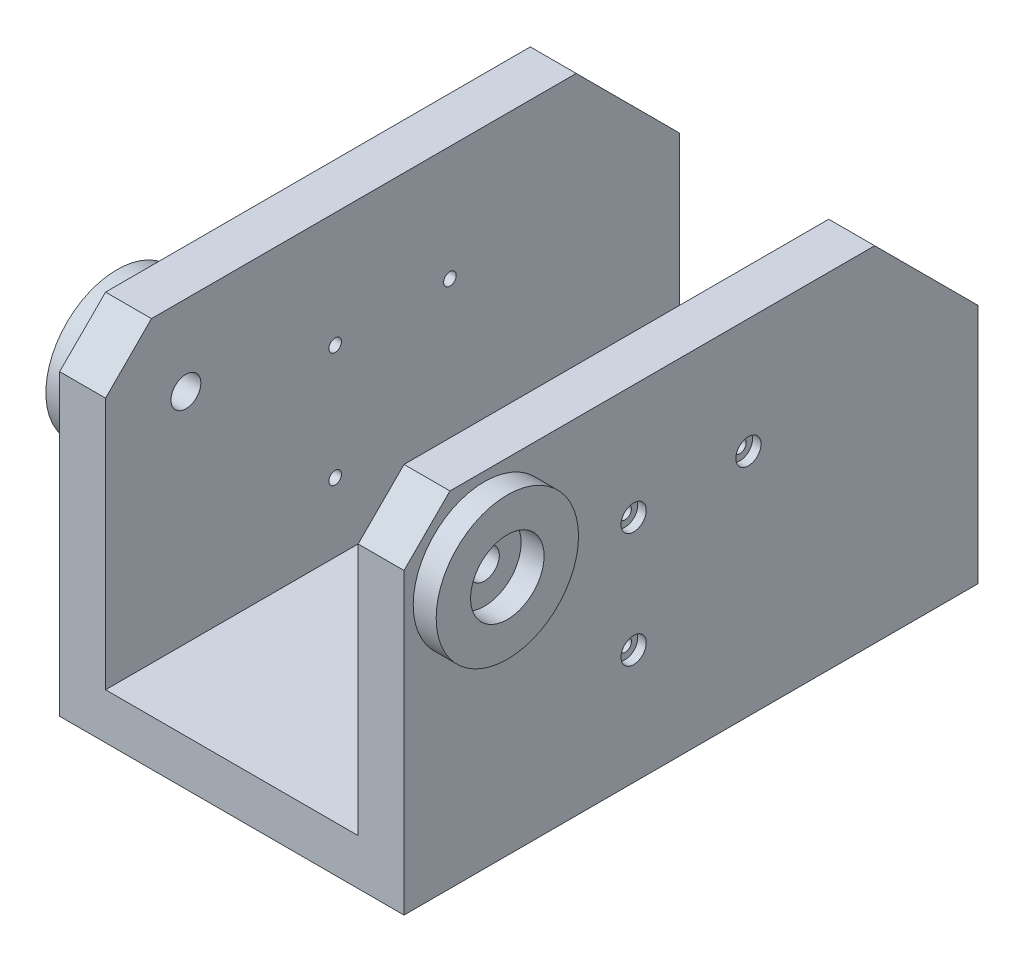
ISO-10303-21;
HEADER;
FILE_DESCRIPTION(('STEP AP214'),'2;1');
FILE_NAME('part.step','',(''),(''),'','','');
FILE_SCHEMA(('AUTOMOTIVE_DESIGN { 1 0 10303 214 1 1 1 1 }'));
ENDSEC;
DATA;
#1=APPLICATION_CONTEXT('core data for automotive mechanical design processes');
#2=APPLICATION_PROTOCOL_DEFINITION('international standard','automotive_design',2000,#1);
#3=PRODUCT_CONTEXT('',#1,'mechanical');
#4=PRODUCT('Part','Part','',(#3));
#5=PRODUCT_RELATED_PRODUCT_CATEGORY('part','',(#4));
#6=PRODUCT_DEFINITION_FORMATION('','',#4);
#7=PRODUCT_DEFINITION_CONTEXT('part definition',#1,'design');
#8=PRODUCT_DEFINITION('design','',#6,#7);
#9=PRODUCT_DEFINITION_SHAPE('','',#8);
#10=(LENGTH_UNIT() NAMED_UNIT(*) SI_UNIT(.MILLI.,.METRE.));
#11=(NAMED_UNIT(*) PLANE_ANGLE_UNIT() SI_UNIT($,.RADIAN.));
#12=(NAMED_UNIT(*) SI_UNIT($,.STERADIAN.) SOLID_ANGLE_UNIT());
#13=UNCERTAINTY_MEASURE_WITH_UNIT(LENGTH_MEASURE(1.E-05),#10,'distance_accuracy_value','');
#14=(GEOMETRIC_REPRESENTATION_CONTEXT(3) GLOBAL_UNCERTAINTY_ASSIGNED_CONTEXT((#13)) GLOBAL_UNIT_ASSIGNED_CONTEXT((#10,
#11,#12)) REPRESENTATION_CONTEXT('',''));
#15=CARTESIAN_POINT('',(0.,0.,0.));
#16=DIRECTION('',(0.,0.,1.));
#17=DIRECTION('',(1.,0.,0.));
#18=AXIS2_PLACEMENT_3D('',#15,#16,#17);
#19=CARTESIAN_POINT('',(-75.,130.,125.));
#20=DIRECTION('',(0.,-1.,0.));
#21=DIRECTION('',(0.,0.,-1.));
#22=AXIS2_PLACEMENT_3D('',#19,#20,#21);
#23=PLANE('',#22);
#24=DIRECTION('',(0.,0.,-1.));
#25=VECTOR('',#24,1.);
#26=CARTESIAN_POINT('',(-55.,130.,125.));
#27=LINE('',#26,#25);
#28=CARTESIAN_POINT('',(-55.,130.,105.));
#29=VERTEX_POINT('',#28);
#30=CARTESIAN_POINT('',(-55.,130.,-80.));
#31=VERTEX_POINT('',#30);
#32=EDGE_CURVE('E161',#29,#31,#27,.T.);
#33=ORIENTED_EDGE('',*,*,#32,.T.);
#34=DIRECTION('',(-1.,0.,0.));
#35=VECTOR('',#34,1.);
#36=CARTESIAN_POINT('',(-75.,130.,-80.));
#37=LINE('',#36,#35);
#38=CARTESIAN_POINT('',(-75.,130.,-80.));
#39=VERTEX_POINT('',#38);
#40=EDGE_CURVE('E227',#31,#39,#37,.T.);
#41=ORIENTED_EDGE('',*,*,#40,.T.);
#42=DIRECTION('',(0.,0.,-1.));
#43=VECTOR('',#42,1.);
#44=CARTESIAN_POINT('',(-75.,130.,125.));
#45=LINE('',#44,#43);
#46=CARTESIAN_POINT('',(-75.,130.,105.));
#47=VERTEX_POINT('',#46);
#48=EDGE_CURVE('E144',#47,#39,#45,.T.);
#49=ORIENTED_EDGE('',*,*,#48,.F.);
#50=DIRECTION('',(1.,0.,0.));
#51=VECTOR('',#50,1.);
#52=CARTESIAN_POINT('',(-75.,130.,105.));
#53=LINE('',#52,#51);
#54=EDGE_CURVE('E212',#47,#29,#53,.T.);
#55=ORIENTED_EDGE('',*,*,#54,.T.);
#56=EDGE_LOOP('',(#33,#41,#49,#55));
#57=FACE_BOUND('',#56,.T.);
#58=ADVANCED_FACE('F32',(#57),#23,.F.);
#59=CARTESIAN_POINT('',(-75.,130.,125.));
#60=DIRECTION('',(1.,0.,0.));
#61=DIRECTION('',(0.,1.,0.));
#62=AXIS2_PLACEMENT_3D('',#59,#60,#61);
#63=PLANE('',#62);
#64=CARTESIAN_POINT('',(-75.,80.,25.));
#65=DIRECTION('',(1.,0.,0.));
#66=DIRECTION('',(0.,1.,0.));
#67=AXIS2_PLACEMENT_3D('',#64,#65,#66);
#68=CIRCLE('',#67,2.74999999999997);
#69=CARTESIAN_POINT('',(-75.,82.75,25.));
#70=VERTEX_POINT('',#69);
#71=EDGE_CURVE('E690',#70,#70,#68,.T.);
#72=ORIENTED_EDGE('',*,*,#71,.T.);
#73=EDGE_LOOP('',(#72));
#74=FACE_BOUND('',#73,.T.);
#75=CARTESIAN_POINT('',(-75.,80.,-25.));
#76=DIRECTION('',(1.,0.,0.));
#77=DIRECTION('',(0.,1.,0.));
#78=AXIS2_PLACEMENT_3D('',#75,#76,#77);
#79=CIRCLE('',#78,2.74999999999997);
#80=CARTESIAN_POINT('',(-75.,82.75,-25.));
#81=VERTEX_POINT('',#80);
#82=EDGE_CURVE('E241',#81,#81,#79,.T.);
#83=ORIENTED_EDGE('',*,*,#82,.T.);
#84=EDGE_LOOP('',(#83));
#85=FACE_BOUND('',#84,.T.);
#86=CARTESIAN_POINT('',(-75.,30.,25.));
#87=DIRECTION('',(1.,0.,0.));
#88=DIRECTION('',(0.,1.,0.));
#89=AXIS2_PLACEMENT_3D('',#86,#87,#88);
#90=CIRCLE('',#89,2.74999999999997);
#91=CARTESIAN_POINT('',(-75.,32.75,25.));
#92=VERTEX_POINT('',#91);
#93=EDGE_CURVE('E232',#92,#92,#90,.T.);
#94=ORIENTED_EDGE('',*,*,#93,.T.);
#95=EDGE_LOOP('',(#94));
#96=FACE_BOUND('',#95,.T.);
#97=CARTESIAN_POINT('',(-75.,95.,90.));
#98=DIRECTION('',(1.,0.,0.));
#99=DIRECTION('',(0.,0.,-1.));
#100=AXIS2_PLACEMENT_3D('',#97,#98,#99);
#101=CIRCLE('',#100,31.);
#102=CARTESIAN_POINT('',(-75.,95.,59.));
#103=VERTEX_POINT('',#102);
#104=EDGE_CURVE('E278',#103,#103,#101,.T.);
#105=ORIENTED_EDGE('',*,*,#104,.T.);
#106=EDGE_LOOP('',(#105));
#107=FACE_BOUND('',#106,.T.);
#108=ORIENTED_EDGE('',*,*,#48,.T.);
#109=DIRECTION('',(0.,-0.707106781186549,-0.707106781186546));
#110=VECTOR('',#109,1.);
#111=CARTESIAN_POINT('',(-75.,130.,-80.));
#112=LINE('',#111,#110);
#113=CARTESIAN_POINT('',(-75.,84.9999999999998,-125.));
#114=VERTEX_POINT('',#113);
#115=EDGE_CURVE('E41',#39,#114,#112,.T.);
#116=ORIENTED_EDGE('',*,*,#115,.T.);
#117=DIRECTION('',(0.,-1.,0.));
#118=VECTOR('',#117,1.);
#119=CARTESIAN_POINT('',(-75.,130.,-125.));
#120=LINE('',#119,#118);
#121=CARTESIAN_POINT('',(-75.,-20.,-125.));
#122=VERTEX_POINT('',#121);
#123=EDGE_CURVE('E141',#114,#122,#120,.T.);
#124=ORIENTED_EDGE('',*,*,#123,.T.);
#125=DIRECTION('',(0.,0.,-1.));
#126=VECTOR('',#125,1.);
#127=CARTESIAN_POINT('',(-75.,-20.,125.));
#128=LINE('',#127,#126);
#129=CARTESIAN_POINT('',(-75.,-20.,125.));
#130=VERTEX_POINT('',#129);
#131=EDGE_CURVE('E137',#130,#122,#128,.T.);
#132=ORIENTED_EDGE('',*,*,#131,.F.);
#133=DIRECTION('',(0.,-1.,0.));
#134=VECTOR('',#133,1.);
#135=CARTESIAN_POINT('',(-75.,130.,125.));
#136=LINE('',#135,#134);
#137=CARTESIAN_POINT('',(-75.,110.,125.));
#138=VERTEX_POINT('',#137);
#139=EDGE_CURVE('E123',#138,#130,#136,.T.);
#140=ORIENTED_EDGE('',*,*,#139,.F.);
#141=DIRECTION('',(0.,-0.707106781186547,0.707106781186549));
#142=VECTOR('',#141,1.);
#143=CARTESIAN_POINT('',(-75.,110.,125.));
#144=LINE('',#143,#142);
#145=EDGE_CURVE('E210',#138,#47,#144,.F.);
#146=ORIENTED_EDGE('',*,*,#145,.T.);
#147=EDGE_LOOP('',(#108,#116,#124,#132,#140,#146));
#148=FACE_BOUND('',#147,.T.);
#149=ADVANCED_FACE('F139',(#74,#85,#96,#107,#148),#63,.F.);
#150=CARTESIAN_POINT('',(-75.,-20.,125.));
#151=DIRECTION('',(0.,1.,0.));
#152=DIRECTION('',(0.,0.,1.));
#153=AXIS2_PLACEMENT_3D('',#150,#151,#152);
#154=PLANE('',#153);
#155=DIRECTION('',(1.,0.,0.));
#156=VECTOR('',#155,1.);
#157=CARTESIAN_POINT('',(-75.,-20.,-125.));
#158=LINE('',#157,#156);
#159=CARTESIAN_POINT('',(75.,-20.,-125.));
#160=VERTEX_POINT('',#159);
#161=EDGE_CURVE('E163',#122,#160,#158,.T.);
#162=ORIENTED_EDGE('',*,*,#161,.T.);
#163=DIRECTION('',(0.,0.,-1.));
#164=VECTOR('',#163,1.);
#165=CARTESIAN_POINT('',(75.,-20.,125.));
#166=LINE('',#165,#164);
#167=CARTESIAN_POINT('',(75.,-20.,125.));
#168=VERTEX_POINT('',#167);
#169=EDGE_CURVE('E145',#168,#160,#166,.T.);
#170=ORIENTED_EDGE('',*,*,#169,.F.);
#171=DIRECTION('',(1.,0.,0.));
#172=VECTOR('',#171,1.);
#173=CARTESIAN_POINT('',(-75.,-20.,125.));
#174=LINE('',#173,#172);
#175=EDGE_CURVE('E128',#130,#168,#174,.T.);
#176=ORIENTED_EDGE('',*,*,#175,.F.);
#177=ORIENTED_EDGE('',*,*,#131,.T.);
#178=EDGE_LOOP('',(#162,#170,#176,#177));
#179=FACE_BOUND('',#178,.T.);
#180=ADVANCED_FACE('F147',(#179),#154,.F.);
#181=CARTESIAN_POINT('',(75.,-20.,125.));
#182=DIRECTION('',(-1.,0.,0.));
#183=DIRECTION('',(0.,0.,1.));
#184=AXIS2_PLACEMENT_3D('',#181,#182,#183);
#185=PLANE('',#184);
#186=CARTESIAN_POINT('',(75.,80.,25.));
#187=DIRECTION('',(1.,0.,0.));
#188=DIRECTION('',(0.,0.,-1.));
#189=AXIS2_PLACEMENT_3D('',#186,#187,#188);
#190=CIRCLE('',#189,5.50000000000001);
#191=CARTESIAN_POINT('',(75.,80.,19.5));
#192=VERTEX_POINT('',#191);
#193=EDGE_CURVE('E680',#192,#192,#190,.T.);
#194=ORIENTED_EDGE('',*,*,#193,.F.);
#195=EDGE_LOOP('',(#194));
#196=FACE_BOUND('',#195,.T.);
#197=CARTESIAN_POINT('',(75.,80.,-25.));
#198=DIRECTION('',(1.,0.,0.));
#199=DIRECTION('',(0.,0.,-1.));
#200=AXIS2_PLACEMENT_3D('',#197,#198,#199);
#201=CIRCLE('',#200,5.50000000000001);
#202=CARTESIAN_POINT('',(75.,80.,-30.5));
#203=VERTEX_POINT('',#202);
#204=EDGE_CURVE('E249',#203,#203,#201,.T.);
#205=ORIENTED_EDGE('',*,*,#204,.F.);
#206=EDGE_LOOP('',(#205));
#207=FACE_BOUND('',#206,.T.);
#208=CARTESIAN_POINT('',(75.,30.,25.));
#209=DIRECTION('',(1.,0.,0.));
#210=DIRECTION('',(0.,0.,-1.));
#211=AXIS2_PLACEMENT_3D('',#208,#209,#210);
#212=CIRCLE('',#211,5.5);
#213=CARTESIAN_POINT('',(75.,30.,19.5));
#214=VERTEX_POINT('',#213);
#215=EDGE_CURVE('E255',#214,#214,#212,.T.);
#216=ORIENTED_EDGE('',*,*,#215,.F.);
#217=EDGE_LOOP('',(#216));
#218=FACE_BOUND('',#217,.T.);
#219=CARTESIAN_POINT('',(75.,95.,90.));
#220=DIRECTION('',(-1.,0.,0.));
#221=DIRECTION('',(0.,0.,1.));
#222=AXIS2_PLACEMENT_3D('',#219,#220,#221);
#223=CIRCLE('',#222,31.);
#224=CARTESIAN_POINT('',(75.,95.,121.));
#225=VERTEX_POINT('',#224);
#226=EDGE_CURVE('E189',#225,#225,#223,.F.);
#227=ORIENTED_EDGE('',*,*,#226,.F.);
#228=EDGE_LOOP('',(#227));
#229=FACE_BOUND('',#228,.T.);
#230=DIRECTION('',(0.,1.,0.));
#231=VECTOR('',#230,1.);
#232=CARTESIAN_POINT('',(75.,-20.,-125.));
#233=LINE('',#232,#231);
#234=CARTESIAN_POINT('',(75.,84.9999999999998,-125.));
#235=VERTEX_POINT('',#234);
#236=EDGE_CURVE('E166',#160,#235,#233,.T.);
#237=ORIENTED_EDGE('',*,*,#236,.T.);
#238=DIRECTION('',(0.,0.707106781186549,0.707106781186546));
#239=VECTOR('',#238,1.);
#240=CARTESIAN_POINT('',(75.,130.,-80.));
#241=LINE('',#240,#239);
#242=CARTESIAN_POINT('',(75.,130.,-79.9999999999999));
#243=VERTEX_POINT('',#242);
#244=EDGE_CURVE('E225',#235,#243,#241,.T.);
#245=ORIENTED_EDGE('',*,*,#244,.T.);
#246=DIRECTION('',(0.,0.,-1.));
#247=VECTOR('',#246,1.);
#248=CARTESIAN_POINT('',(75.,130.,125.));
#249=LINE('',#248,#247);
#250=CARTESIAN_POINT('',(75.,130.,105.));
#251=VERTEX_POINT('',#250);
#252=EDGE_CURVE('E184',#251,#243,#249,.T.);
#253=ORIENTED_EDGE('',*,*,#252,.F.);
#254=DIRECTION('',(0.,0.707106781186546,-0.707106781186549));
#255=VECTOR('',#254,1.);
#256=CARTESIAN_POINT('',(75.,110.,125.));
#257=LINE('',#256,#255);
#258=CARTESIAN_POINT('',(75.,110.,125.));
#259=VERTEX_POINT('',#258);
#260=EDGE_CURVE('E208',#251,#259,#257,.F.);
#261=ORIENTED_EDGE('',*,*,#260,.T.);
#262=DIRECTION('',(0.,1.,0.));
#263=VECTOR('',#262,1.);
#264=CARTESIAN_POINT('',(75.,-20.,125.));
#265=LINE('',#264,#263);
#266=EDGE_CURVE('E150',#168,#259,#265,.T.);
#267=ORIENTED_EDGE('',*,*,#266,.F.);
#268=ORIENTED_EDGE('',*,*,#169,.T.);
#269=EDGE_LOOP('',(#237,#245,#253,#261,#267,#268));
#270=FACE_BOUND('',#269,.T.);
#271=ADVANCED_FACE('F302',(#196,#207,#218,#229,#270),#185,.F.);
#272=CARTESIAN_POINT('',(55.,130.,125.));
#273=DIRECTION('',(0.,-1.,0.));
#274=DIRECTION('',(0.,0.,-1.));
#275=AXIS2_PLACEMENT_3D('',#272,#273,#274);
#276=PLANE('',#275);
#277=ORIENTED_EDGE('',*,*,#252,.T.);
#278=DIRECTION('',(-1.,0.,0.));
#279=VECTOR('',#278,1.);
#280=CARTESIAN_POINT('',(55.,130.,-80.));
#281=LINE('',#280,#279);
#282=CARTESIAN_POINT('',(55.,130.,-79.9999999999999));
#283=VERTEX_POINT('',#282);
#284=EDGE_CURVE('E216',#243,#283,#281,.T.);
#285=ORIENTED_EDGE('',*,*,#284,.T.);
#286=DIRECTION('',(0.,0.,-1.));
#287=VECTOR('',#286,1.);
#288=CARTESIAN_POINT('',(55.,130.,125.));
#289=LINE('',#288,#287);
#290=CARTESIAN_POINT('',(55.,130.,105.));
#291=VERTEX_POINT('',#290);
#292=EDGE_CURVE('E181',#291,#283,#289,.T.);
#293=ORIENTED_EDGE('',*,*,#292,.F.);
#294=DIRECTION('',(1.,0.,0.));
#295=VECTOR('',#294,1.);
#296=CARTESIAN_POINT('',(55.,130.,105.));
#297=LINE('',#296,#295);
#298=EDGE_CURVE('E206',#291,#251,#297,.T.);
#299=ORIENTED_EDGE('',*,*,#298,.T.);
#300=EDGE_LOOP('',(#277,#285,#293,#299));
#301=FACE_BOUND('',#300,.T.);
#302=ADVANCED_FACE('F305',(#301),#276,.F.);
#303=CARTESIAN_POINT('',(55.,0.,125.));
#304=DIRECTION('',(1.,0.,0.));
#305=DIRECTION('',(0.,1.,0.));
#306=AXIS2_PLACEMENT_3D('',#303,#304,#305);
#307=PLANE('',#306);
#308=CARTESIAN_POINT('',(55.,80.,25.));
#309=DIRECTION('',(1.,0.,0.));
#310=DIRECTION('',(0.,1.,0.));
#311=AXIS2_PLACEMENT_3D('',#308,#309,#310);
#312=CIRCLE('',#311,2.74999999999997);
#313=CARTESIAN_POINT('',(55.,82.75,25.));
#314=VERTEX_POINT('',#313);
#315=EDGE_CURVE('E687',#314,#314,#312,.T.);
#316=ORIENTED_EDGE('',*,*,#315,.T.);
#317=EDGE_LOOP('',(#316));
#318=FACE_BOUND('',#317,.T.);
#319=CARTESIAN_POINT('',(55.,80.,-25.));
#320=DIRECTION('',(1.,0.,0.));
#321=DIRECTION('',(0.,1.,0.));
#322=AXIS2_PLACEMENT_3D('',#319,#320,#321);
#323=CIRCLE('',#322,2.74999999999997);
#324=CARTESIAN_POINT('',(55.,82.75,-25.));
#325=VERTEX_POINT('',#324);
#326=EDGE_CURVE('E236',#325,#325,#323,.T.);
#327=ORIENTED_EDGE('',*,*,#326,.T.);
#328=EDGE_LOOP('',(#327));
#329=FACE_BOUND('',#328,.T.);
#330=CARTESIAN_POINT('',(55.,30.,25.));
#331=DIRECTION('',(1.,0.,0.));
#332=DIRECTION('',(0.,1.,0.));
#333=AXIS2_PLACEMENT_3D('',#330,#331,#332);
#334=CIRCLE('',#333,2.74999999999997);
#335=CARTESIAN_POINT('',(55.,32.75,25.));
#336=VERTEX_POINT('',#335);
#337=EDGE_CURVE('E265',#336,#336,#334,.T.);
#338=ORIENTED_EDGE('',*,*,#337,.T.);
#339=EDGE_LOOP('',(#338));
#340=FACE_BOUND('',#339,.T.);
#341=CARTESIAN_POINT('',(55.,95.,90.));
#342=DIRECTION('',(1.,0.,0.));
#343=DIRECTION('',(0.,1.,0.));
#344=AXIS2_PLACEMENT_3D('',#341,#342,#343);
#345=CIRCLE('',#344,6.5);
#346=CARTESIAN_POINT('',(55.,101.5,90.));
#347=VERTEX_POINT('',#346);
#348=EDGE_CURVE('E272',#347,#347,#345,.T.);
#349=ORIENTED_EDGE('',*,*,#348,.T.);
#350=EDGE_LOOP('',(#349));
#351=FACE_BOUND('',#350,.T.);
#352=ORIENTED_EDGE('',*,*,#292,.T.);
#353=DIRECTION('',(0.,-0.707106781186549,-0.707106781186546));
#354=VECTOR('',#353,1.);
#355=CARTESIAN_POINT('',(55.,130.,-80.));
#356=LINE('',#355,#354);
#357=CARTESIAN_POINT('',(55.,84.9999999999998,-125.));
#358=VERTEX_POINT('',#357);
#359=EDGE_CURVE('E219',#283,#358,#356,.T.);
#360=ORIENTED_EDGE('',*,*,#359,.T.);
#361=DIRECTION('',(0.,-1.,0.));
#362=VECTOR('',#361,1.);
#363=CARTESIAN_POINT('',(55.,0.,-125.));
#364=LINE('',#363,#362);
#365=CARTESIAN_POINT('',(55.,0.,-125.));
#366=VERTEX_POINT('',#365);
#367=EDGE_CURVE('E169',#358,#366,#364,.T.);
#368=ORIENTED_EDGE('',*,*,#367,.T.);
#369=DIRECTION('',(0.,0.,-1.));
#370=VECTOR('',#369,1.);
#371=CARTESIAN_POINT('',(55.,0.,125.));
#372=LINE('',#371,#370);
#373=CARTESIAN_POINT('',(55.,0.,125.));
#374=VERTEX_POINT('',#373);
#375=EDGE_CURVE('E178',#374,#366,#372,.T.);
#376=ORIENTED_EDGE('',*,*,#375,.F.);
#377=DIRECTION('',(0.,-1.,0.));
#378=VECTOR('',#377,1.);
#379=CARTESIAN_POINT('',(55.,0.,125.));
#380=LINE('',#379,#378);
#381=CARTESIAN_POINT('',(55.,110.,125.));
#382=VERTEX_POINT('',#381);
#383=EDGE_CURVE('E152',#382,#374,#380,.T.);
#384=ORIENTED_EDGE('',*,*,#383,.F.);
#385=DIRECTION('',(0.,-0.707106781186546,0.707106781186549));
#386=VECTOR('',#385,1.);
#387=CARTESIAN_POINT('',(55.,110.,125.));
#388=LINE('',#387,#386);
#389=EDGE_CURVE('E204',#382,#291,#388,.F.);
#390=ORIENTED_EDGE('',*,*,#389,.T.);
#391=EDGE_LOOP('',(#352,#360,#368,#376,#384,#390));
#392=FACE_BOUND('',#391,.T.);
#393=ADVANCED_FACE('F321',(#318,#329,#340,#351,#392),#307,.F.);
#394=CARTESIAN_POINT('',(-55.,0.,125.));
#395=DIRECTION('',(0.,-1.,0.));
#396=DIRECTION('',(1.,0.,0.));
#397=AXIS2_PLACEMENT_3D('',#394,#395,#396);
#398=PLANE('',#397);
#399=DIRECTION('',(-1.,0.,0.));
#400=VECTOR('',#399,1.);
#401=CARTESIAN_POINT('',(-55.,0.,-125.));
#402=LINE('',#401,#400);
#403=CARTESIAN_POINT('',(-55.,0.,-125.));
#404=VERTEX_POINT('',#403);
#405=EDGE_CURVE('E171',#366,#404,#402,.T.);
#406=ORIENTED_EDGE('',*,*,#405,.T.);
#407=DIRECTION('',(0.,0.,-1.));
#408=VECTOR('',#407,1.);
#409=CARTESIAN_POINT('',(-55.,0.,125.));
#410=LINE('',#409,#408);
#411=CARTESIAN_POINT('',(-55.,0.,125.));
#412=VERTEX_POINT('',#411);
#413=EDGE_CURVE('E175',#412,#404,#410,.T.);
#414=ORIENTED_EDGE('',*,*,#413,.F.);
#415=DIRECTION('',(-1.,0.,0.));
#416=VECTOR('',#415,1.);
#417=CARTESIAN_POINT('',(-55.,0.,125.));
#418=LINE('',#417,#416);
#419=EDGE_CURVE('E157',#374,#412,#418,.T.);
#420=ORIENTED_EDGE('',*,*,#419,.F.);
#421=ORIENTED_EDGE('',*,*,#375,.T.);
#422=EDGE_LOOP('',(#406,#414,#420,#421));
#423=FACE_BOUND('',#422,.T.);
#424=ADVANCED_FACE('F333',(#423),#398,.F.);
#425=CARTESIAN_POINT('',(-55.,130.,125.));
#426=DIRECTION('',(-1.,0.,0.));
#427=DIRECTION('',(0.,-1.,0.));
#428=AXIS2_PLACEMENT_3D('',#425,#426,#427);
#429=PLANE('',#428);
#430=CARTESIAN_POINT('',(-55.,80.,25.));
#431=DIRECTION('',(-1.,0.,0.));
#432=DIRECTION('',(0.,-1.,0.));
#433=AXIS2_PLACEMENT_3D('',#430,#431,#432);
#434=CIRCLE('',#433,2.74999999999997);
#435=CARTESIAN_POINT('',(-55.,77.2500000000001,25.));
#436=VERTEX_POINT('',#435);
#437=EDGE_CURVE('E36',#436,#436,#434,.T.);
#438=ORIENTED_EDGE('',*,*,#437,.T.);
#439=EDGE_LOOP('',(#438));
#440=FACE_BOUND('',#439,.T.);
#441=CARTESIAN_POINT('',(-55.,80.,-25.));
#442=DIRECTION('',(-1.,0.,0.));
#443=DIRECTION('',(0.,-1.,0.));
#444=AXIS2_PLACEMENT_3D('',#441,#442,#443);
#445=CIRCLE('',#444,2.74999999999997);
#446=CARTESIAN_POINT('',(-55.,77.2500000000001,-25.));
#447=VERTEX_POINT('',#446);
#448=EDGE_CURVE('E234',#447,#447,#445,.T.);
#449=ORIENTED_EDGE('',*,*,#448,.T.);
#450=EDGE_LOOP('',(#449));
#451=FACE_BOUND('',#450,.T.);
#452=CARTESIAN_POINT('',(-55.,30.,25.));
#453=DIRECTION('',(-1.,0.,0.));
#454=DIRECTION('',(0.,-1.,0.));
#455=AXIS2_PLACEMENT_3D('',#452,#453,#454);
#456=CIRCLE('',#455,2.74999999999997);
#457=CARTESIAN_POINT('',(-55.,27.2500000000001,25.));
#458=VERTEX_POINT('',#457);
#459=EDGE_CURVE('E230',#458,#458,#456,.T.);
#460=ORIENTED_EDGE('',*,*,#459,.T.);
#461=EDGE_LOOP('',(#460));
#462=FACE_BOUND('',#461,.T.);
#463=CARTESIAN_POINT('',(-55.,95.,90.));
#464=DIRECTION('',(-1.,0.,0.));
#465=DIRECTION('',(0.,-1.,0.));
#466=AXIS2_PLACEMENT_3D('',#463,#464,#465);
#467=CIRCLE('',#466,6.5);
#468=CARTESIAN_POINT('',(-55.,88.5,90.));
#469=VERTEX_POINT('',#468);
#470=EDGE_CURVE('E198',#469,#469,#467,.T.);
#471=ORIENTED_EDGE('',*,*,#470,.T.);
#472=EDGE_LOOP('',(#471));
#473=FACE_BOUND('',#472,.T.);
#474=DIRECTION('',(0.,1.,0.));
#475=VECTOR('',#474,1.);
#476=CARTESIAN_POINT('',(-55.,130.,-125.));
#477=LINE('',#476,#475);
#478=CARTESIAN_POINT('',(-55.,84.9999999999999,-125.));
#479=VERTEX_POINT('',#478);
#480=EDGE_CURVE('E134',#404,#479,#477,.T.);
#481=ORIENTED_EDGE('',*,*,#480,.T.);
#482=DIRECTION('',(0.,0.707106781186549,0.707106781186546));
#483=VECTOR('',#482,1.);
#484=CARTESIAN_POINT('',(-55.,130.,-80.));
#485=LINE('',#484,#483);
#486=EDGE_CURVE('E11',#479,#31,#485,.T.);
#487=ORIENTED_EDGE('',*,*,#486,.T.);
#488=ORIENTED_EDGE('',*,*,#32,.F.);
#489=DIRECTION('',(0.,0.707106781186547,-0.707106781186549));
#490=VECTOR('',#489,1.);
#491=CARTESIAN_POINT('',(-55.,110.,125.));
#492=LINE('',#491,#490);
#493=CARTESIAN_POINT('',(-55.,110.,125.));
#494=VERTEX_POINT('',#493);
#495=EDGE_CURVE('E214',#29,#494,#492,.F.);
#496=ORIENTED_EDGE('',*,*,#495,.T.);
#497=DIRECTION('',(0.,1.,0.));
#498=VECTOR('',#497,1.);
#499=CARTESIAN_POINT('',(-55.,130.,125.));
#500=LINE('',#499,#498);
#501=EDGE_CURVE('E159',#412,#494,#500,.T.);
#502=ORIENTED_EDGE('',*,*,#501,.F.);
#503=ORIENTED_EDGE('',*,*,#413,.T.);
#504=EDGE_LOOP('',(#481,#487,#488,#496,#502,#503));
#505=FACE_BOUND('',#504,.T.);
#506=ADVANCED_FACE('F336',(#440,#451,#462,#473,#505),#429,.F.);
#507=CARTESIAN_POINT('',(0.,0.,125.));
#508=DIRECTION('',(0.,0.,-1.));
#509=DIRECTION('',(-1.,0.,0.));
#510=AXIS2_PLACEMENT_3D('',#507,#508,#509);
#511=PLANE('',#510);
#512=ORIENTED_EDGE('',*,*,#266,.T.);
#513=DIRECTION('',(-1.,0.,0.));
#514=VECTOR('',#513,1.);
#515=CARTESIAN_POINT('',(0.,110.,125.));
#516=LINE('',#515,#514);
#517=EDGE_CURVE('E201',#259,#382,#516,.T.);
#518=ORIENTED_EDGE('',*,*,#517,.T.);
#519=ORIENTED_EDGE('',*,*,#383,.T.);
#520=ORIENTED_EDGE('',*,*,#419,.T.);
#521=ORIENTED_EDGE('',*,*,#501,.T.);
#522=DIRECTION('',(-1.,0.,0.));
#523=VECTOR('',#522,1.);
#524=CARTESIAN_POINT('',(0.,110.,125.));
#525=LINE('',#524,#523);
#526=EDGE_CURVE('E132',#494,#138,#525,.T.);
#527=ORIENTED_EDGE('',*,*,#526,.T.);
#528=ORIENTED_EDGE('',*,*,#139,.T.);
#529=ORIENTED_EDGE('',*,*,#175,.T.);
#530=EDGE_LOOP('',(#512,#518,#519,#520,#521,#527,#528,#529));
#531=FACE_BOUND('',#530,.T.);
#532=ADVANCED_FACE('F126',(#531),#511,.F.);
#533=CARTESIAN_POINT('',(0.,0.,-125.));
#534=DIRECTION('',(0.,0.,-1.));
#535=DIRECTION('',(-1.,0.,0.));
#536=AXIS2_PLACEMENT_3D('',#533,#534,#535);
#537=PLANE('',#536);
#538=ORIENTED_EDGE('',*,*,#367,.F.);
#539=DIRECTION('',(1.,0.,0.));
#540=VECTOR('',#539,1.);
#541=CARTESIAN_POINT('',(75.,84.9999999999998,-125.));
#542=LINE('',#541,#540);
#543=EDGE_CURVE('E223',#358,#235,#542,.T.);
#544=ORIENTED_EDGE('',*,*,#543,.T.);
#545=ORIENTED_EDGE('',*,*,#236,.F.);
#546=ORIENTED_EDGE('',*,*,#161,.F.);
#547=ORIENTED_EDGE('',*,*,#123,.F.);
#548=DIRECTION('',(1.,0.,0.));
#549=VECTOR('',#548,1.);
#550=CARTESIAN_POINT('',(-55.,84.9999999999998,-125.));
#551=LINE('',#550,#549);
#552=EDGE_CURVE('E221',#114,#479,#551,.T.);
#553=ORIENTED_EDGE('',*,*,#552,.T.);
#554=ORIENTED_EDGE('',*,*,#480,.F.);
#555=ORIENTED_EDGE('',*,*,#405,.F.);
#556=EDGE_LOOP('',(#538,#544,#545,#546,#547,#553,#554,#555));
#557=FACE_BOUND('',#556,.T.);
#558=ADVANCED_FACE('F343',(#557),#537,.T.);
#559=CARTESIAN_POINT('',(85.,95.,90.));
#560=DIRECTION('',(1.,0.,0.));
#561=DIRECTION('',(0.,0.,-1.));
#562=AXIS2_PLACEMENT_3D('',#559,#560,#561);
#563=PLANE('',#562);
#564=CARTESIAN_POINT('',(85.,95.,90.));
#565=DIRECTION('',(1.,0.,0.));
#566=DIRECTION('',(0.,0.,-1.));
#567=AXIS2_PLACEMENT_3D('',#564,#565,#566);
#568=CIRCLE('',#567,31.);
#569=CARTESIAN_POINT('',(85.,95.,59.));
#570=VERTEX_POINT('',#569);
#571=EDGE_CURVE('E164',#570,#570,#568,.T.);
#572=ORIENTED_EDGE('',*,*,#571,.T.);
#573=EDGE_LOOP('',(#572));
#574=FACE_BOUND('',#573,.T.);
#575=CARTESIAN_POINT('',(85.,95.,90.));
#576=DIRECTION('',(1.,0.,0.));
#577=DIRECTION('',(0.,0.,-1.));
#578=AXIS2_PLACEMENT_3D('',#575,#576,#577);
#579=CIRCLE('',#578,16.);
#580=CARTESIAN_POINT('',(85.,95.,74.));
#581=VERTEX_POINT('',#580);
#582=EDGE_CURVE('E285',#581,#581,#579,.T.);
#583=ORIENTED_EDGE('',*,*,#582,.F.);
#584=EDGE_LOOP('',(#583));
#585=FACE_BOUND('',#584,.T.);
#586=ADVANCED_FACE('F292',(#574,#585),#563,.T.);
#587=CARTESIAN_POINT('',(85.,95.,90.));
#588=DIRECTION('',(-1.,0.,0.));
#589=DIRECTION('',(0.,0.,1.));
#590=AXIS2_PLACEMENT_3D('',#587,#588,#589);
#591=CYLINDRICAL_SURFACE('',#590,31.);
#592=ORIENTED_EDGE('',*,*,#571,.F.);
#593=EDGE_LOOP('',(#592));
#594=FACE_BOUND('',#593,.T.);
#595=ORIENTED_EDGE('',*,*,#226,.T.);
#596=EDGE_LOOP('',(#595));
#597=FACE_BOUND('',#596,.T.);
#598=ADVANCED_FACE('F295',(#594,#597),#591,.T.);
#599=CARTESIAN_POINT('',(85.,95.,90.));
#600=DIRECTION('',(-1.,0.,0.));
#601=DIRECTION('',(0.,0.,1.));
#602=AXIS2_PLACEMENT_3D('',#599,#600,#601);
#603=CYLINDRICAL_SURFACE('',#602,16.);
#604=ORIENTED_EDGE('',*,*,#582,.T.);
#605=EDGE_LOOP('',(#604));
#606=FACE_BOUND('',#605,.T.);
#607=CARTESIAN_POINT('',(75.,95.,90.));
#608=DIRECTION('',(1.,0.,0.));
#609=DIRECTION('',(0.,0.,-1.));
#610=AXIS2_PLACEMENT_3D('',#607,#608,#609);
#611=CIRCLE('',#610,16.);
#612=CARTESIAN_POINT('',(75.,95.,74.));
#613=VERTEX_POINT('',#612);
#614=EDGE_CURVE('E282',#613,#613,#611,.T.);
#615=ORIENTED_EDGE('',*,*,#614,.F.);
#616=EDGE_LOOP('',(#615));
#617=FACE_BOUND('',#616,.T.);
#618=ADVANCED_FACE('F298',(#606,#617),#603,.F.);
#619=CARTESIAN_POINT('',(75.,95.,90.));
#620=DIRECTION('',(1.,0.,0.));
#621=DIRECTION('',(0.,0.,-1.));
#622=AXIS2_PLACEMENT_3D('',#619,#620,#621);
#623=CIRCLE('',#622,6.5);
#624=CARTESIAN_POINT('',(75.,95.,83.5));
#625=VERTEX_POINT('',#624);
#626=EDGE_CURVE('E199',#625,#625,#623,.T.);
#627=ORIENTED_EDGE('',*,*,#626,.F.);
#628=EDGE_LOOP('',(#627));
#629=FACE_BOUND('',#628,.T.);
#630=ORIENTED_EDGE('',*,*,#614,.T.);
#631=EDGE_LOOP('',(#630));
#632=FACE_BOUND('',#631,.T.);
#633=ADVANCED_FACE('F308',(#629,#632),#185,.F.);
#634=CARTESIAN_POINT('',(-85.,95.,90.));
#635=DIRECTION('',(1.,0.,0.));
#636=DIRECTION('',(0.,0.,-1.));
#637=AXIS2_PLACEMENT_3D('',#634,#635,#636);
#638=CYLINDRICAL_SURFACE('',#637,31.);
#639=CARTESIAN_POINT('',(-85.,95.,90.));
#640=DIRECTION('',(1.,0.,0.));
#641=DIRECTION('',(0.,0.,-1.));
#642=AXIS2_PLACEMENT_3D('',#639,#640,#641);
#643=CIRCLE('',#642,31.);
#644=CARTESIAN_POINT('',(-85.,95.,59.));
#645=VERTEX_POINT('',#644);
#646=EDGE_CURVE('E279',#645,#645,#643,.T.);
#647=ORIENTED_EDGE('',*,*,#646,.T.);
#648=EDGE_LOOP('',(#647));
#649=FACE_BOUND('',#648,.T.);
#650=ORIENTED_EDGE('',*,*,#104,.F.);
#651=EDGE_LOOP('',(#650));
#652=FACE_BOUND('',#651,.T.);
#653=ADVANCED_FACE('F399',(#649,#652),#638,.T.);
#654=CARTESIAN_POINT('',(-85.,95.,90.));
#655=DIRECTION('',(-1.,0.,0.));
#656=DIRECTION('',(0.,0.,-1.));
#657=AXIS2_PLACEMENT_3D('',#654,#655,#656);
#658=PLANE('',#657);
#659=CARTESIAN_POINT('',(-85.,95.,90.));
#660=DIRECTION('',(1.,0.,0.));
#661=DIRECTION('',(0.,0.,-1.));
#662=AXIS2_PLACEMENT_3D('',#659,#660,#661);
#663=CIRCLE('',#662,16.);
#664=CARTESIAN_POINT('',(-85.,95.,74.));
#665=VERTEX_POINT('',#664);
#666=EDGE_CURVE('E275',#665,#665,#663,.T.);
#667=ORIENTED_EDGE('',*,*,#666,.T.);
#668=EDGE_LOOP('',(#667));
#669=FACE_BOUND('',#668,.T.);
#670=ORIENTED_EDGE('',*,*,#646,.F.);
#671=EDGE_LOOP('',(#670));
#672=FACE_BOUND('',#671,.T.);
#673=ADVANCED_FACE('F395',(#669,#672),#658,.T.);
#674=CARTESIAN_POINT('',(-85.,95.,90.));
#675=DIRECTION('',(1.,0.,0.));
#676=DIRECTION('',(0.,0.,-1.));
#677=AXIS2_PLACEMENT_3D('',#674,#675,#676);
#678=CYLINDRICAL_SURFACE('',#677,16.);
#679=ORIENTED_EDGE('',*,*,#666,.F.);
#680=EDGE_LOOP('',(#679));
#681=FACE_BOUND('',#680,.T.);
#682=CARTESIAN_POINT('',(-75.,95.,90.));
#683=DIRECTION('',(1.,0.,0.));
#684=DIRECTION('',(0.,1.,0.));
#685=AXIS2_PLACEMENT_3D('',#682,#683,#684);
#686=CIRCLE('',#685,16.);
#687=CARTESIAN_POINT('',(-75.,111.,90.));
#688=VERTEX_POINT('',#687);
#689=EDGE_CURVE('E192',#688,#688,#686,.T.);
#690=ORIENTED_EDGE('',*,*,#689,.T.);
#691=EDGE_LOOP('',(#690));
#692=FACE_BOUND('',#691,.T.);
#693=ADVANCED_FACE('F392',(#681,#692),#678,.F.);
#694=CARTESIAN_POINT('',(-75.,95.,90.));
#695=DIRECTION('',(1.,0.,0.));
#696=DIRECTION('',(0.,1.,0.));
#697=AXIS2_PLACEMENT_3D('',#694,#695,#696);
#698=CIRCLE('',#697,6.5);
#699=CARTESIAN_POINT('',(-75.,101.5,90.));
#700=VERTEX_POINT('',#699);
#701=EDGE_CURVE('E195',#700,#700,#698,.T.);
#702=ORIENTED_EDGE('',*,*,#701,.T.);
#703=EDGE_LOOP('',(#702));
#704=FACE_BOUND('',#703,.T.);
#705=ORIENTED_EDGE('',*,*,#689,.F.);
#706=EDGE_LOOP('',(#705));
#707=FACE_BOUND('',#706,.T.);
#708=ADVANCED_FACE('F360',(#704,#707),#63,.F.);
#709=CARTESIAN_POINT('',(-85.,95.,90.));
#710=DIRECTION('',(1.,0.,0.));
#711=DIRECTION('',(0.,0.,-1.));
#712=AXIS2_PLACEMENT_3D('',#709,#710,#711);
#713=CYLINDRICAL_SURFACE('',#712,6.5);
#714=ORIENTED_EDGE('',*,*,#701,.F.);
#715=EDGE_LOOP('',(#714));
#716=FACE_BOUND('',#715,.T.);
#717=ORIENTED_EDGE('',*,*,#470,.F.);
#718=EDGE_LOOP('',(#717));
#719=FACE_BOUND('',#718,.T.);
#720=ADVANCED_FACE('F390',(#716,#719),#713,.F.);
#721=ORIENTED_EDGE('',*,*,#626,.T.);
#722=EDGE_LOOP('',(#721));
#723=FACE_BOUND('',#722,.T.);
#724=ORIENTED_EDGE('',*,*,#348,.F.);
#725=EDGE_LOOP('',(#724));
#726=FACE_BOUND('',#725,.T.);
#727=ADVANCED_FACE('F365',(#723,#726),#713,.F.);
#728=CARTESIAN_POINT('',(0.,110.,125.));
#729=DIRECTION('',(0.,-0.707106781186549,-0.707106781186546));
#730=DIRECTION('',(-1.,0.,0.));
#731=AXIS2_PLACEMENT_3D('',#728,#729,#730);
#732=PLANE('',#731);
#733=ORIENTED_EDGE('',*,*,#260,.F.);
#734=ORIENTED_EDGE('',*,*,#298,.F.);
#735=ORIENTED_EDGE('',*,*,#389,.F.);
#736=ORIENTED_EDGE('',*,*,#517,.F.);
#737=EDGE_LOOP('',(#733,#734,#735,#736));
#738=FACE_BOUND('',#737,.T.);
#739=ADVANCED_FACE('F328',(#738),#732,.F.);
#740=CARTESIAN_POINT('',(0.,110.,125.));
#741=DIRECTION('',(0.,-0.707106781186549,-0.707106781186547));
#742=DIRECTION('',(-1.,0.,0.));
#743=AXIS2_PLACEMENT_3D('',#740,#741,#742);
#744=PLANE('',#743);
#745=ORIENTED_EDGE('',*,*,#495,.F.);
#746=ORIENTED_EDGE('',*,*,#54,.F.);
#747=ORIENTED_EDGE('',*,*,#145,.F.);
#748=ORIENTED_EDGE('',*,*,#526,.F.);
#749=EDGE_LOOP('',(#745,#746,#747,#748));
#750=FACE_BOUND('',#749,.T.);
#751=ADVANCED_FACE('F339',(#750),#744,.F.);
#752=CARTESIAN_POINT('',(55.,130.,-80.));
#753=DIRECTION('',(0.,0.707106781186546,-0.707106781186549));
#754=DIRECTION('',(1.,0.,0.));
#755=AXIS2_PLACEMENT_3D('',#752,#753,#754);
#756=PLANE('',#755);
#757=ORIENTED_EDGE('',*,*,#244,.F.);
#758=ORIENTED_EDGE('',*,*,#543,.F.);
#759=ORIENTED_EDGE('',*,*,#359,.F.);
#760=ORIENTED_EDGE('',*,*,#284,.F.);
#761=EDGE_LOOP('',(#757,#758,#759,#760));
#762=FACE_BOUND('',#761,.T.);
#763=ADVANCED_FACE('F316',(#762),#756,.T.);
#764=CARTESIAN_POINT('',(-75.,130.,-80.));
#765=DIRECTION('',(0.,0.707106781186546,-0.707106781186549));
#766=DIRECTION('',(1.,0.,0.));
#767=AXIS2_PLACEMENT_3D('',#764,#765,#766);
#768=PLANE('',#767);
#769=ORIENTED_EDGE('',*,*,#486,.F.);
#770=ORIENTED_EDGE('',*,*,#552,.F.);
#771=ORIENTED_EDGE('',*,*,#115,.F.);
#772=ORIENTED_EDGE('',*,*,#40,.F.);
#773=EDGE_LOOP('',(#769,#770,#771,#772));
#774=FACE_BOUND('',#773,.T.);
#775=ADVANCED_FACE('F34',(#774),#768,.T.);
#776=CARTESIAN_POINT('',(75.,30.,25.));
#777=DIRECTION('',(1.,0.,0.));
#778=DIRECTION('',(0.,0.,-1.));
#779=AXIS2_PLACEMENT_3D('',#776,#777,#778);
#780=CYLINDRICAL_SURFACE('',#779,2.74999999999997);
#781=ORIENTED_EDGE('',*,*,#459,.F.);
#782=EDGE_LOOP('',(#781));
#783=FACE_BOUND('',#782,.T.);
#784=ORIENTED_EDGE('',*,*,#93,.F.);
#785=EDGE_LOOP('',(#784));
#786=FACE_BOUND('',#785,.T.);
#787=ADVANCED_FACE('F371',(#783,#786),#780,.F.);
#788=CARTESIAN_POINT('',(71.3,30.,25.));
#789=DIRECTION('',(1.,0.,0.));
#790=DIRECTION('',(0.,0.,-1.));
#791=AXIS2_PLACEMENT_3D('',#788,#789,#790);
#792=CIRCLE('',#791,2.75);
#793=CARTESIAN_POINT('',(71.3,30.,22.25));
#794=VERTEX_POINT('',#793);
#795=EDGE_CURVE('E233',#794,#794,#792,.T.);
#796=ORIENTED_EDGE('',*,*,#795,.T.);
#797=EDGE_LOOP('',(#796));
#798=FACE_BOUND('',#797,.T.);
#799=ORIENTED_EDGE('',*,*,#337,.F.);
#800=EDGE_LOOP('',(#799));
#801=FACE_BOUND('',#800,.T.);
#802=ADVANCED_FACE('F375',(#798,#801),#780,.F.);
#803=CARTESIAN_POINT('',(71.3,32.75,25.));
#804=DIRECTION('',(-1.,0.,0.));
#805=DIRECTION('',(0.,0.,1.));
#806=AXIS2_PLACEMENT_3D('',#803,#804,#805);
#807=PLANE('',#806);
#808=ORIENTED_EDGE('',*,*,#795,.F.);
#809=EDGE_LOOP('',(#808));
#810=FACE_BOUND('',#809,.T.);
#811=CARTESIAN_POINT('',(71.3,30.,25.));
#812=DIRECTION('',(1.,0.,0.));
#813=DIRECTION('',(0.,0.,-1.));
#814=AXIS2_PLACEMENT_3D('',#811,#812,#813);
#815=CIRCLE('',#814,5.5);
#816=CARTESIAN_POINT('',(71.3,30.,19.5));
#817=VERTEX_POINT('',#816);
#818=EDGE_CURVE('E258',#817,#817,#815,.T.);
#819=ORIENTED_EDGE('',*,*,#818,.T.);
#820=EDGE_LOOP('',(#819));
#821=FACE_BOUND('',#820,.T.);
#822=ADVANCED_FACE('F381',(#810,#821),#807,.F.);
#823=CARTESIAN_POINT('',(75.,30.,25.));
#824=DIRECTION('',(1.,0.,0.));
#825=DIRECTION('',(0.,0.,-1.));
#826=AXIS2_PLACEMENT_3D('',#823,#824,#825);
#827=CYLINDRICAL_SURFACE('',#826,5.5);
#828=ORIENTED_EDGE('',*,*,#818,.F.);
#829=EDGE_LOOP('',(#828));
#830=FACE_BOUND('',#829,.T.);
#831=ORIENTED_EDGE('',*,*,#215,.T.);
#832=EDGE_LOOP('',(#831));
#833=FACE_BOUND('',#832,.T.);
#834=ADVANCED_FACE('F585',(#830,#833),#827,.F.);
#835=CARTESIAN_POINT('',(75.,80.,-25.));
#836=DIRECTION('',(1.,0.,0.));
#837=DIRECTION('',(0.,0.,-1.));
#838=AXIS2_PLACEMENT_3D('',#835,#836,#837);
#839=CYLINDRICAL_SURFACE('',#838,2.74999999999997);
#840=ORIENTED_EDGE('',*,*,#448,.F.);
#841=EDGE_LOOP('',(#840));
#842=FACE_BOUND('',#841,.T.);
#843=ORIENTED_EDGE('',*,*,#82,.F.);
#844=EDGE_LOOP('',(#843));
#845=FACE_BOUND('',#844,.T.);
#846=ADVANCED_FACE('F593',(#842,#845),#839,.F.);
#847=CARTESIAN_POINT('',(71.3,80.,-25.));
#848=DIRECTION('',(1.,0.,0.));
#849=DIRECTION('',(0.,0.,-1.));
#850=AXIS2_PLACEMENT_3D('',#847,#848,#849);
#851=CIRCLE('',#850,2.75);
#852=CARTESIAN_POINT('',(71.3,80.,-27.75));
#853=VERTEX_POINT('',#852);
#854=EDGE_CURVE('E237',#853,#853,#851,.T.);
#855=ORIENTED_EDGE('',*,*,#854,.T.);
#856=EDGE_LOOP('',(#855));
#857=FACE_BOUND('',#856,.T.);
#858=ORIENTED_EDGE('',*,*,#326,.F.);
#859=EDGE_LOOP('',(#858));
#860=FACE_BOUND('',#859,.T.);
#861=ADVANCED_FACE('F601',(#857,#860),#839,.F.);
#862=CARTESIAN_POINT('',(71.3,82.75,-25.));
#863=DIRECTION('',(-1.,0.,0.));
#864=DIRECTION('',(0.,0.,1.));
#865=AXIS2_PLACEMENT_3D('',#862,#863,#864);
#866=PLANE('',#865);
#867=ORIENTED_EDGE('',*,*,#854,.F.);
#868=EDGE_LOOP('',(#867));
#869=FACE_BOUND('',#868,.T.);
#870=CARTESIAN_POINT('',(71.3,80.,-25.));
#871=DIRECTION('',(1.,0.,0.));
#872=DIRECTION('',(0.,0.,-1.));
#873=AXIS2_PLACEMENT_3D('',#870,#871,#872);
#874=CIRCLE('',#873,5.50000000000001);
#875=CARTESIAN_POINT('',(71.3,80.,-30.5));
#876=VERTEX_POINT('',#875);
#877=EDGE_CURVE('E244',#876,#876,#874,.T.);
#878=ORIENTED_EDGE('',*,*,#877,.T.);
#879=EDGE_LOOP('',(#878));
#880=FACE_BOUND('',#879,.T.);
#881=ADVANCED_FACE('F610',(#869,#880),#866,.F.);
#882=CARTESIAN_POINT('',(75.,80.,-25.));
#883=DIRECTION('',(1.,0.,0.));
#884=DIRECTION('',(0.,0.,-1.));
#885=AXIS2_PLACEMENT_3D('',#882,#883,#884);
#886=CYLINDRICAL_SURFACE('',#885,5.50000000000001);
#887=ORIENTED_EDGE('',*,*,#877,.F.);
#888=EDGE_LOOP('',(#887));
#889=FACE_BOUND('',#888,.T.);
#890=ORIENTED_EDGE('',*,*,#204,.T.);
#891=EDGE_LOOP('',(#890));
#892=FACE_BOUND('',#891,.T.);
#893=ADVANCED_FACE('F617',(#889,#892),#886,.F.);
#894=CARTESIAN_POINT('',(75.,80.,25.));
#895=DIRECTION('',(1.,0.,0.));
#896=DIRECTION('',(0.,0.,-1.));
#897=AXIS2_PLACEMENT_3D('',#894,#895,#896);
#898=CYLINDRICAL_SURFACE('',#897,2.74999999999997);
#899=ORIENTED_EDGE('',*,*,#437,.F.);
#900=EDGE_LOOP('',(#899));
#901=FACE_BOUND('',#900,.T.);
#902=ORIENTED_EDGE('',*,*,#71,.F.);
#903=EDGE_LOOP('',(#902));
#904=FACE_BOUND('',#903,.T.);
#905=ADVANCED_FACE('F626',(#901,#904),#898,.F.);
#906=CARTESIAN_POINT('',(71.3,80.,25.));
#907=DIRECTION('',(1.,0.,0.));
#908=DIRECTION('',(0.,0.,-1.));
#909=AXIS2_PLACEMENT_3D('',#906,#907,#908);
#910=CIRCLE('',#909,2.75);
#911=CARTESIAN_POINT('',(71.3,80.,22.25));
#912=VERTEX_POINT('',#911);
#913=EDGE_CURVE('E682',#912,#912,#910,.T.);
#914=ORIENTED_EDGE('',*,*,#913,.T.);
#915=EDGE_LOOP('',(#914));
#916=FACE_BOUND('',#915,.T.);
#917=ORIENTED_EDGE('',*,*,#315,.F.);
#918=EDGE_LOOP('',(#917));
#919=FACE_BOUND('',#918,.T.);
#920=ADVANCED_FACE('F635',(#916,#919),#898,.F.);
#921=CARTESIAN_POINT('',(71.3,82.75,25.));
#922=DIRECTION('',(-1.,0.,0.));
#923=DIRECTION('',(0.,0.,1.));
#924=AXIS2_PLACEMENT_3D('',#921,#922,#923);
#925=PLANE('',#924);
#926=ORIENTED_EDGE('',*,*,#913,.F.);
#927=EDGE_LOOP('',(#926));
#928=FACE_BOUND('',#927,.T.);
#929=CARTESIAN_POINT('',(71.3,80.,25.));
#930=DIRECTION('',(1.,0.,0.));
#931=DIRECTION('',(0.,0.,-1.));
#932=AXIS2_PLACEMENT_3D('',#929,#930,#931);
#933=CIRCLE('',#932,5.50000000000001);
#934=CARTESIAN_POINT('',(71.3,80.,19.5));
#935=VERTEX_POINT('',#934);
#936=EDGE_CURVE('E677',#935,#935,#933,.T.);
#937=ORIENTED_EDGE('',*,*,#936,.T.);
#938=EDGE_LOOP('',(#937));
#939=FACE_BOUND('',#938,.T.);
#940=ADVANCED_FACE('F644',(#928,#939),#925,.F.);
#941=CARTESIAN_POINT('',(75.,80.,25.));
#942=DIRECTION('',(1.,0.,0.));
#943=DIRECTION('',(0.,0.,-1.));
#944=AXIS2_PLACEMENT_3D('',#941,#942,#943);
#945=CYLINDRICAL_SURFACE('',#944,5.50000000000001);
#946=ORIENTED_EDGE('',*,*,#936,.F.);
#947=EDGE_LOOP('',(#946));
#948=FACE_BOUND('',#947,.T.);
#949=ORIENTED_EDGE('',*,*,#193,.T.);
#950=EDGE_LOOP('',(#949));
#951=FACE_BOUND('',#950,.T.);
#952=ADVANCED_FACE('F652',(#948,#951),#945,.F.);
#953=CLOSED_SHELL('',(#58,#149,#180,#271,#302,#393,#424,#506,#532,#558,#586,#598,#618,#633,#653,
#673,#693,#708,#720,#727,#739,#751,#763,#775,#787,#802,#822,#834,#846,#861,#881,#893,#905,#920,
#940,#952));
#954=MANIFOLD_SOLID_BREP('B2',#953);
#955=ADVANCED_BREP_SHAPE_REPRESENTATION('',(#18,#954),#14);
#956=SHAPE_DEFINITION_REPRESENTATION(#9,#955);
ENDSEC;
END-ISO-10303-21;
